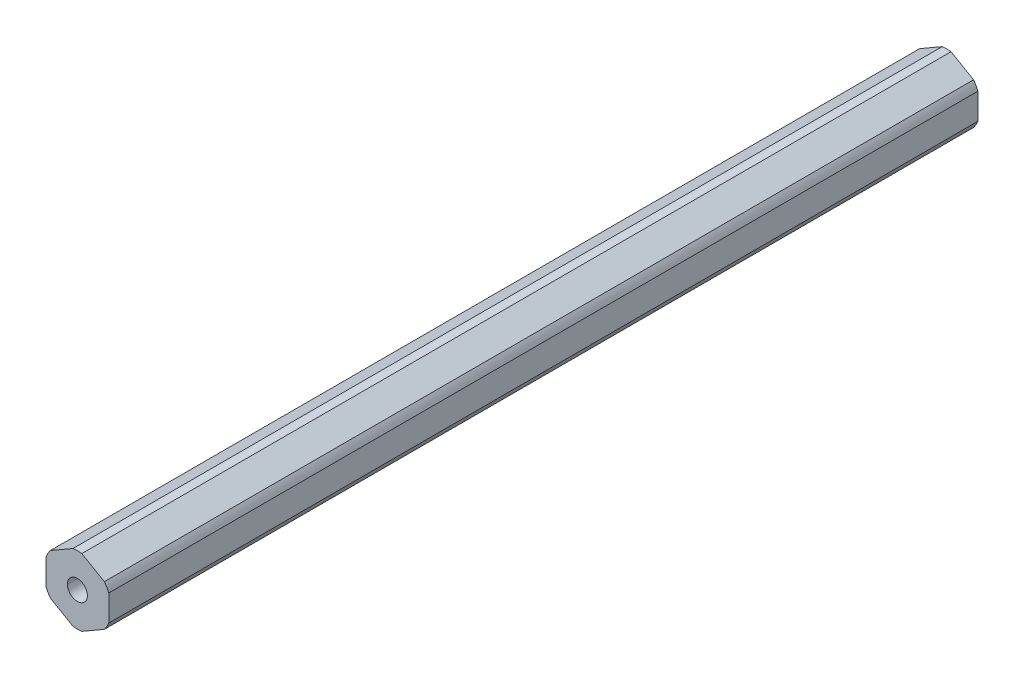
ISO-10303-21;
HEADER;
FILE_DESCRIPTION(('STEP AP214'),'2;1');
FILE_NAME('part.step','',(''),(''),'','','');
FILE_SCHEMA(('AUTOMOTIVE_DESIGN { 1 0 10303 214 1 1 1 1 }'));
ENDSEC;
DATA;
#1=APPLICATION_CONTEXT('core data for automotive mechanical design processes');
#2=APPLICATION_PROTOCOL_DEFINITION('international standard','automotive_design',2000,#1);
#3=PRODUCT_CONTEXT('',#1,'mechanical');
#4=PRODUCT('Part','Part','',(#3));
#5=PRODUCT_RELATED_PRODUCT_CATEGORY('part','',(#4));
#6=PRODUCT_DEFINITION_FORMATION('','',#4);
#7=PRODUCT_DEFINITION_CONTEXT('part definition',#1,'design');
#8=PRODUCT_DEFINITION('design','',#6,#7);
#9=PRODUCT_DEFINITION_SHAPE('','',#8);
#10=(LENGTH_UNIT() NAMED_UNIT(*) SI_UNIT(.MILLI.,.METRE.));
#11=(NAMED_UNIT(*) PLANE_ANGLE_UNIT() SI_UNIT($,.RADIAN.));
#12=(NAMED_UNIT(*) SI_UNIT($,.STERADIAN.) SOLID_ANGLE_UNIT());
#13=UNCERTAINTY_MEASURE_WITH_UNIT(LENGTH_MEASURE(1.E-05),#10,'distance_accuracy_value','');
#14=(GEOMETRIC_REPRESENTATION_CONTEXT(3) GLOBAL_UNCERTAINTY_ASSIGNED_CONTEXT((#13)) GLOBAL_UNIT_ASSIGNED_CONTEXT((#10,
#11,#12)) REPRESENTATION_CONTEXT('',''));
#15=CARTESIAN_POINT('',(0.,0.,0.));
#16=DIRECTION('',(0.,0.,1.));
#17=DIRECTION('',(1.,0.,0.));
#18=AXIS2_PLACEMENT_3D('',#15,#16,#17);
#19=CARTESIAN_POINT('',(0.,0.,457.2));
#20=DIRECTION('',(0.,0.,-1.));
#21=DIRECTION('',(-1.,0.,0.));
#22=AXIS2_PLACEMENT_3D('',#19,#20,#21);
#23=CYLINDRICAL_SURFACE('',#22,6.87);
#24=DIRECTION('',(0.,0.,-1.));
#25=VECTOR('',#24,1.);
#26=CARTESIAN_POINT('',(6.345,-2.63398462410091,457.2));
#27=LINE('',#26,#25);
#28=CARTESIAN_POINT('',(6.345,-2.63398462410091,-281.432));
#29=VERTEX_POINT('',#28);
#30=CARTESIAN_POINT('',(6.345,-2.63398462410091,-457.2));
#31=VERTEX_POINT('',#30);
#32=EDGE_CURVE('E226',#29,#31,#27,.T.);
#33=ORIENTED_EDGE('',*,*,#32,.F.);
#34=CARTESIAN_POINT('',(0.,0.,-281.432));
#35=DIRECTION('',(0.,0.,1.));
#36=DIRECTION('',(1.,0.,0.));
#37=AXIS2_PLACEMENT_3D('',#34,#35,#36);
#38=CIRCLE('',#37,6.87);
#39=CARTESIAN_POINT('',(5.45359759764899,-4.17793887496181,-281.432));
#40=VERTEX_POINT('',#39);
#41=EDGE_CURVE('E51',#29,#40,#38,.F.);
#42=ORIENTED_EDGE('',*,*,#41,.T.);
#43=DIRECTION('',(0.,0.,-1.));
#44=VECTOR('',#43,1.);
#45=CARTESIAN_POINT('',(5.45359759764899,-4.17793887496181,457.2));
#46=LINE('',#45,#44);
#47=CARTESIAN_POINT('',(5.45359759764899,-4.17793887496181,-457.2));
#48=VERTEX_POINT('',#47);
#49=EDGE_CURVE('E184',#40,#48,#46,.T.);
#50=ORIENTED_EDGE('',*,*,#49,.T.);
#51=CARTESIAN_POINT('',(0.,0.,-457.2));
#52=DIRECTION('',(0.,0.,1.));
#53=DIRECTION('',(1.,0.,0.));
#54=AXIS2_PLACEMENT_3D('',#51,#52,#53);
#55=CIRCLE('',#54,6.87);
#56=EDGE_CURVE('E44',#48,#31,#55,.T.);
#57=ORIENTED_EDGE('',*,*,#56,.T.);
#58=EDGE_LOOP('',(#33,#42,#50,#57));
#59=FACE_BOUND('',#58,.T.);
#60=ADVANCED_FACE('F36',(#59),#23,.T.);
#61=CARTESIAN_POINT('',(0.,0.,457.2));
#62=DIRECTION('',(0.,0.,-1.));
#63=DIRECTION('',(-1.,0.,0.));
#64=AXIS2_PLACEMENT_3D('',#61,#62,#63);
#65=CYLINDRICAL_SURFACE('',#64,2.0193);
#66=CARTESIAN_POINT('',(0.,0.,-281.432));
#67=DIRECTION('',(0.,0.,1.));
#68=DIRECTION('',(1.,0.,0.));
#69=AXIS2_PLACEMENT_3D('',#66,#67,#68);
#70=CIRCLE('',#69,2.0193);
#71=CARTESIAN_POINT('',(-2.0193,0.,-281.432));
#72=VERTEX_POINT('',#71);
#73=CARTESIAN_POINT('',(2.0193,0.,-281.432));
#74=VERTEX_POINT('',#73);
#75=EDGE_CURVE('E57',#72,#74,#70,.F.);
#76=ORIENTED_EDGE('',*,*,#75,.F.);
#77=DIRECTION('',(0.,0.,-1.));
#78=VECTOR('',#77,1.);
#79=CARTESIAN_POINT('',(-2.0193,0.,457.2));
#80=LINE('',#79,#78);
#81=CARTESIAN_POINT('',(-2.0193,0.,-457.2));
#82=VERTEX_POINT('',#81);
#83=EDGE_CURVE('E196',#72,#82,#80,.T.);
#84=ORIENTED_EDGE('',*,*,#83,.T.);
#85=CARTESIAN_POINT('',(0.,0.,-457.2));
#86=DIRECTION('',(0.,0.,1.));
#87=DIRECTION('',(1.,0.,0.));
#88=AXIS2_PLACEMENT_3D('',#85,#86,#87);
#89=CIRCLE('',#88,2.0193);
#90=CARTESIAN_POINT('',(2.0193,0.,-457.2));
#91=VERTEX_POINT('',#90);
#92=EDGE_CURVE('E186',#91,#82,#89,.T.);
#93=ORIENTED_EDGE('',*,*,#92,.F.);
#94=DIRECTION('',(0.,0.,-1.));
#95=VECTOR('',#94,1.);
#96=CARTESIAN_POINT('',(2.0193,0.,457.2));
#97=LINE('',#96,#95);
#98=EDGE_CURVE('E166',#74,#91,#97,.T.);
#99=ORIENTED_EDGE('',*,*,#98,.F.);
#100=EDGE_LOOP('',(#76,#84,#93,#99));
#101=FACE_BOUND('',#100,.T.);
#102=ADVANCED_FACE('F320',(#101),#65,.F.);
#103=CARTESIAN_POINT('',(3.1725,-5.49493118701227,457.2));
#104=DIRECTION('',(-0.5,0.866025403784439,0.));
#105=DIRECTION('',(0.,0.,1.));
#106=AXIS2_PLACEMENT_3D('',#103,#104,#105);
#107=PLANE('',#106);
#108=DIRECTION('',(0.866025403784439,0.5,0.));
#109=VECTOR('',#108,1.);
#110=CARTESIAN_POINT('',(3.1725,-5.49493118701227,-281.432));
#111=LINE('',#110,#109);
#112=CARTESIAN_POINT('',(0.891402402351008,-6.81192349906272,-281.432));
#113=VERTEX_POINT('',#112);
#114=EDGE_CURVE('E272',#113,#40,#111,.T.);
#115=ORIENTED_EDGE('',*,*,#114,.F.);
#116=DIRECTION('',(0.,0.,-1.));
#117=VECTOR('',#116,1.);
#118=CARTESIAN_POINT('',(0.891402402351008,-6.81192349906272,457.2));
#119=LINE('',#118,#117);
#120=CARTESIAN_POINT('',(0.891402402351008,-6.81192349906272,-457.2));
#121=VERTEX_POINT('',#120);
#122=EDGE_CURVE('E199',#113,#121,#119,.T.);
#123=ORIENTED_EDGE('',*,*,#122,.T.);
#124=DIRECTION('',(0.866025403784439,0.5,0.));
#125=VECTOR('',#124,1.);
#126=CARTESIAN_POINT('',(3.1725,-5.49493118701227,-457.2));
#127=LINE('',#126,#125);
#128=EDGE_CURVE('E187',#121,#48,#127,.T.);
#129=ORIENTED_EDGE('',*,*,#128,.T.);
#130=ORIENTED_EDGE('',*,*,#49,.F.);
#131=EDGE_LOOP('',(#115,#123,#129,#130));
#132=FACE_BOUND('',#131,.T.);
#133=ADVANCED_FACE('F314',(#132),#107,.F.);
#134=CARTESIAN_POINT('',(0.,0.,457.2));
#135=DIRECTION('',(0.,0.,-1.));
#136=DIRECTION('',(-1.,0.,0.));
#137=AXIS2_PLACEMENT_3D('',#134,#135,#136);
#138=CYLINDRICAL_SURFACE('',#137,6.87);
#139=ORIENTED_EDGE('',*,*,#122,.F.);
#140=CARTESIAN_POINT('',(0.,0.,-281.432));
#141=DIRECTION('',(0.,0.,1.));
#142=DIRECTION('',(1.,0.,0.));
#143=AXIS2_PLACEMENT_3D('',#140,#141,#142);
#144=CIRCLE('',#143,6.87);
#145=CARTESIAN_POINT('',(-0.891402402351014,-6.81192349906272,-281.432));
#146=VERTEX_POINT('',#145);
#147=EDGE_CURVE('E269',#113,#146,#144,.F.);
#148=ORIENTED_EDGE('',*,*,#147,.T.);
#149=DIRECTION('',(0.,0.,-1.));
#150=VECTOR('',#149,1.);
#151=CARTESIAN_POINT('',(-0.891402402351014,-6.81192349906272,457.2));
#152=LINE('',#151,#150);
#153=CARTESIAN_POINT('',(-0.891402402351014,-6.81192349906272,-457.2));
#154=VERTEX_POINT('',#153);
#155=EDGE_CURVE('E188',#146,#154,#152,.T.);
#156=ORIENTED_EDGE('',*,*,#155,.T.);
#157=CARTESIAN_POINT('',(0.,0.,-457.2));
#158=DIRECTION('',(0.,0.,1.));
#159=DIRECTION('',(1.,0.,0.));
#160=AXIS2_PLACEMENT_3D('',#157,#158,#159);
#161=CIRCLE('',#160,6.87);
#162=EDGE_CURVE('E190',#154,#121,#161,.T.);
#163=ORIENTED_EDGE('',*,*,#162,.T.);
#164=EDGE_LOOP('',(#139,#148,#156,#163));
#165=FACE_BOUND('',#164,.T.);
#166=ADVANCED_FACE('F38',(#165),#138,.T.);
#167=CARTESIAN_POINT('',(-3.1725,-5.49493118701226,457.2));
#168=DIRECTION('',(0.5,0.866025403784439,0.));
#169=DIRECTION('',(0.,0.,-1.));
#170=AXIS2_PLACEMENT_3D('',#167,#168,#169);
#171=PLANE('',#170);
#172=DIRECTION('',(0.866025403784439,-0.5,0.));
#173=VECTOR('',#172,1.);
#174=CARTESIAN_POINT('',(-3.1725,-5.49493118701226,-281.432));
#175=LINE('',#174,#173);
#176=CARTESIAN_POINT('',(-5.45359759764899,-4.17793887496181,-281.432));
#177=VERTEX_POINT('',#176);
#178=EDGE_CURVE('E167',#177,#146,#175,.T.);
#179=ORIENTED_EDGE('',*,*,#178,.F.);
#180=DIRECTION('',(0.,0.,-1.));
#181=VECTOR('',#180,1.);
#182=CARTESIAN_POINT('',(-5.45359759764899,-4.17793887496181,457.2));
#183=LINE('',#182,#181);
#184=CARTESIAN_POINT('',(-5.45359759764899,-4.17793887496181,-457.2));
#185=VERTEX_POINT('',#184);
#186=EDGE_CURVE('E165',#177,#185,#183,.T.);
#187=ORIENTED_EDGE('',*,*,#186,.T.);
#188=DIRECTION('',(0.866025403784439,-0.5,0.));
#189=VECTOR('',#188,1.);
#190=CARTESIAN_POINT('',(-3.1725,-5.49493118701226,-457.2));
#191=LINE('',#190,#189);
#192=EDGE_CURVE('E191',#185,#154,#191,.T.);
#193=ORIENTED_EDGE('',*,*,#192,.T.);
#194=ORIENTED_EDGE('',*,*,#155,.F.);
#195=EDGE_LOOP('',(#179,#187,#193,#194));
#196=FACE_BOUND('',#195,.T.);
#197=ADVANCED_FACE('F311',(#196),#171,.F.);
#198=CARTESIAN_POINT('',(0.,0.,457.2));
#199=DIRECTION('',(0.,0.,-1.));
#200=DIRECTION('',(-1.,0.,0.));
#201=AXIS2_PLACEMENT_3D('',#198,#199,#200);
#202=CYLINDRICAL_SURFACE('',#201,6.87);
#203=ORIENTED_EDGE('',*,*,#186,.F.);
#204=CARTESIAN_POINT('',(0.,0.,-281.432));
#205=DIRECTION('',(0.,0.,1.));
#206=DIRECTION('',(1.,0.,0.));
#207=AXIS2_PLACEMENT_3D('',#204,#205,#206);
#208=CIRCLE('',#207,6.87);
#209=CARTESIAN_POINT('',(-6.345,-2.63398462410091,-281.432));
#210=VERTEX_POINT('',#209);
#211=EDGE_CURVE('E151',#177,#210,#208,.F.);
#212=ORIENTED_EDGE('',*,*,#211,.T.);
#213=DIRECTION('',(0.,0.,-1.));
#214=VECTOR('',#213,1.);
#215=CARTESIAN_POINT('',(-6.345,-2.63398462410091,457.2));
#216=LINE('',#215,#214);
#217=CARTESIAN_POINT('',(-6.345,-2.63398462410091,-457.2));
#218=VERTEX_POINT('',#217);
#219=EDGE_CURVE('E163',#210,#218,#216,.T.);
#220=ORIENTED_EDGE('',*,*,#219,.T.);
#221=CARTESIAN_POINT('',(0.,0.,-457.2));
#222=DIRECTION('',(0.,0.,1.));
#223=DIRECTION('',(1.,0.,0.));
#224=AXIS2_PLACEMENT_3D('',#221,#222,#223);
#225=CIRCLE('',#224,6.87);
#226=EDGE_CURVE('E173',#218,#185,#225,.T.);
#227=ORIENTED_EDGE('',*,*,#226,.T.);
#228=EDGE_LOOP('',(#203,#212,#220,#227));
#229=FACE_BOUND('',#228,.T.);
#230=ADVANCED_FACE('F161',(#229),#202,.T.);
#231=CARTESIAN_POINT('',(-6.345,0.,457.2));
#232=DIRECTION('',(1.,0.,0.));
#233=DIRECTION('',(0.,1.,0.));
#234=AXIS2_PLACEMENT_3D('',#231,#232,#233);
#235=PLANE('',#234);
#236=DIRECTION('',(0.,1.,0.));
#237=VECTOR('',#236,1.);
#238=CARTESIAN_POINT('',(-6.345,0.,-281.432));
#239=LINE('',#238,#237);
#240=CARTESIAN_POINT('',(-6.345,2.63398462410091,-281.432));
#241=VERTEX_POINT('',#240);
#242=EDGE_CURVE('E148',#210,#241,#239,.T.);
#243=ORIENTED_EDGE('',*,*,#242,.T.);
#244=DIRECTION('',(0.,0.,-1.));
#245=VECTOR('',#244,1.);
#246=CARTESIAN_POINT('',(-6.345,2.63398462410091,457.2));
#247=LINE('',#246,#245);
#248=CARTESIAN_POINT('',(-6.345,2.63398462410091,-457.2));
#249=VERTEX_POINT('',#248);
#250=EDGE_CURVE('E178',#241,#249,#247,.T.);
#251=ORIENTED_EDGE('',*,*,#250,.T.);
#252=DIRECTION('',(0.,-1.,0.));
#253=VECTOR('',#252,1.);
#254=CARTESIAN_POINT('',(-6.345,0.,-457.2));
#255=LINE('',#254,#253);
#256=EDGE_CURVE('E172',#249,#218,#255,.T.);
#257=ORIENTED_EDGE('',*,*,#256,.T.);
#258=ORIENTED_EDGE('',*,*,#219,.F.);
#259=EDGE_LOOP('',(#243,#251,#257,#258));
#260=FACE_BOUND('',#259,.T.);
#261=ADVANCED_FACE('F170',(#260),#235,.F.);
#262=CARTESIAN_POINT('',(0.,0.,457.2));
#263=DIRECTION('',(0.,0.,-1.));
#264=DIRECTION('',(-1.,0.,0.));
#265=AXIS2_PLACEMENT_3D('',#262,#263,#264);
#266=CYLINDRICAL_SURFACE('',#265,6.87);
#267=ORIENTED_EDGE('',*,*,#250,.F.);
#268=CARTESIAN_POINT('',(0.,0.,-281.432));
#269=DIRECTION('',(0.,0.,1.));
#270=DIRECTION('',(1.,0.,0.));
#271=AXIS2_PLACEMENT_3D('',#268,#269,#270);
#272=CIRCLE('',#271,6.87);
#273=CARTESIAN_POINT('',(-5.45359759764899,4.17793887496182,-281.432));
#274=VERTEX_POINT('',#273);
#275=EDGE_CURVE('E154',#241,#274,#272,.F.);
#276=ORIENTED_EDGE('',*,*,#275,.T.);
#277=DIRECTION('',(0.,0.,-1.));
#278=VECTOR('',#277,1.);
#279=CARTESIAN_POINT('',(-5.45359759764899,4.17793887496182,457.2));
#280=LINE('',#279,#278);
#281=CARTESIAN_POINT('',(-5.45359759764899,4.17793887496182,-457.2));
#282=VERTEX_POINT('',#281);
#283=EDGE_CURVE('E259',#274,#282,#280,.T.);
#284=ORIENTED_EDGE('',*,*,#283,.T.);
#285=CARTESIAN_POINT('',(0.,0.,-457.2));
#286=DIRECTION('',(0.,0.,1.));
#287=DIRECTION('',(1.,0.,0.));
#288=AXIS2_PLACEMENT_3D('',#285,#286,#287);
#289=CIRCLE('',#288,6.87);
#290=EDGE_CURVE('E181',#282,#249,#289,.T.);
#291=ORIENTED_EDGE('',*,*,#290,.T.);
#292=EDGE_LOOP('',(#267,#276,#284,#291));
#293=FACE_BOUND('',#292,.T.);
#294=ADVANCED_FACE('F333',(#293),#266,.T.);
#295=CARTESIAN_POINT('',(-3.1725,5.49493118701227,457.2));
#296=DIRECTION('',(0.5,-0.866025403784439,0.));
#297=DIRECTION('',(0.,0.,-1.));
#298=AXIS2_PLACEMENT_3D('',#295,#296,#297);
#299=PLANE('',#298);
#300=DIRECTION('',(-0.866025403784439,-0.5,0.));
#301=VECTOR('',#300,1.);
#302=CARTESIAN_POINT('',(-3.1725,5.49493118701227,-281.432));
#303=LINE('',#302,#301);
#304=CARTESIAN_POINT('',(-0.891402402351016,6.81192349906272,-281.432));
#305=VERTEX_POINT('',#304);
#306=EDGE_CURVE('E276',#305,#274,#303,.T.);
#307=ORIENTED_EDGE('',*,*,#306,.F.);
#308=DIRECTION('',(0.,0.,-1.));
#309=VECTOR('',#308,1.);
#310=CARTESIAN_POINT('',(-0.891402402351017,6.81192349906272,457.2));
#311=LINE('',#310,#309);
#312=CARTESIAN_POINT('',(-0.891402402351017,6.81192349906272,-457.2));
#313=VERTEX_POINT('',#312);
#314=EDGE_CURVE('E235',#305,#313,#311,.T.);
#315=ORIENTED_EDGE('',*,*,#314,.T.);
#316=DIRECTION('',(-0.866025403784439,-0.5,0.));
#317=VECTOR('',#316,1.);
#318=CARTESIAN_POINT('',(-3.1725,5.49493118701227,-457.2));
#319=LINE('',#318,#317);
#320=EDGE_CURVE('E212',#313,#282,#319,.T.);
#321=ORIENTED_EDGE('',*,*,#320,.T.);
#322=ORIENTED_EDGE('',*,*,#283,.F.);
#323=EDGE_LOOP('',(#307,#315,#321,#322));
#324=FACE_BOUND('',#323,.T.);
#325=ADVANCED_FACE('F306',(#324),#299,.F.);
#326=CARTESIAN_POINT('',(0.,0.,457.2));
#327=DIRECTION('',(0.,0.,-1.));
#328=DIRECTION('',(-1.,0.,0.));
#329=AXIS2_PLACEMENT_3D('',#326,#327,#328);
#330=CYLINDRICAL_SURFACE('',#329,6.87);
#331=ORIENTED_EDGE('',*,*,#314,.F.);
#332=CARTESIAN_POINT('',(0.,0.,-281.432));
#333=DIRECTION('',(0.,0.,1.));
#334=DIRECTION('',(1.,0.,0.));
#335=AXIS2_PLACEMENT_3D('',#332,#333,#334);
#336=CIRCLE('',#335,6.87);
#337=CARTESIAN_POINT('',(0.891402402351022,6.81192349906272,-281.432));
#338=VERTEX_POINT('',#337);
#339=EDGE_CURVE('E278',#305,#338,#336,.F.);
#340=ORIENTED_EDGE('',*,*,#339,.T.);
#341=DIRECTION('',(0.,0.,-1.));
#342=VECTOR('',#341,1.);
#343=CARTESIAN_POINT('',(0.891402402351022,6.81192349906272,457.2));
#344=LINE('',#343,#342);
#345=CARTESIAN_POINT('',(0.891402402351022,6.81192349906272,-457.2));
#346=VERTEX_POINT('',#345);
#347=EDGE_CURVE('E222',#338,#346,#344,.T.);
#348=ORIENTED_EDGE('',*,*,#347,.T.);
#349=CARTESIAN_POINT('',(0.,0.,-457.2));
#350=DIRECTION('',(0.,0.,1.));
#351=DIRECTION('',(1.,0.,0.));
#352=AXIS2_PLACEMENT_3D('',#349,#350,#351);
#353=CIRCLE('',#352,6.87);
#354=EDGE_CURVE('E244',#346,#313,#353,.T.);
#355=ORIENTED_EDGE('',*,*,#354,.T.);
#356=EDGE_LOOP('',(#331,#340,#348,#355));
#357=FACE_BOUND('',#356,.T.);
#358=ADVANCED_FACE('F303',(#357),#330,.T.);
#359=CARTESIAN_POINT('',(3.1725,5.49493118701227,457.2));
#360=DIRECTION('',(-0.5,-0.866025403784439,0.));
#361=DIRECTION('',(-0.866025403784439,0.5,0.));
#362=AXIS2_PLACEMENT_3D('',#359,#360,#361);
#363=PLANE('',#362);
#364=DIRECTION('',(-0.866025403784439,0.5,0.));
#365=VECTOR('',#364,1.);
#366=CARTESIAN_POINT('',(3.1725,5.49493118701227,-281.432));
#367=LINE('',#366,#365);
#368=CARTESIAN_POINT('',(5.45359759764898,4.17793887496182,-281.432));
#369=VERTEX_POINT('',#368);
#370=EDGE_CURVE('E281',#369,#338,#367,.T.);
#371=ORIENTED_EDGE('',*,*,#370,.F.);
#372=DIRECTION('',(0.,0.,-1.));
#373=VECTOR('',#372,1.);
#374=CARTESIAN_POINT('',(5.45359759764898,4.17793887496182,457.2));
#375=LINE('',#374,#373);
#376=CARTESIAN_POINT('',(5.45359759764898,4.17793887496182,-457.2));
#377=VERTEX_POINT('',#376);
#378=EDGE_CURVE('E213',#369,#377,#375,.T.);
#379=ORIENTED_EDGE('',*,*,#378,.T.);
#380=DIRECTION('',(-0.866025403784439,0.5,0.));
#381=VECTOR('',#380,1.);
#382=CARTESIAN_POINT('',(3.1725,5.49493118701227,-457.2));
#383=LINE('',#382,#381);
#384=EDGE_CURVE('E214',#377,#346,#383,.T.);
#385=ORIENTED_EDGE('',*,*,#384,.T.);
#386=ORIENTED_EDGE('',*,*,#347,.F.);
#387=EDGE_LOOP('',(#371,#379,#385,#386));
#388=FACE_BOUND('',#387,.T.);
#389=ADVANCED_FACE('F300',(#388),#363,.F.);
#390=CARTESIAN_POINT('',(0.,0.,457.2));
#391=DIRECTION('',(0.,0.,-1.));
#392=DIRECTION('',(-1.,0.,0.));
#393=AXIS2_PLACEMENT_3D('',#390,#391,#392);
#394=CYLINDRICAL_SURFACE('',#393,6.87);
#395=ORIENTED_EDGE('',*,*,#378,.F.);
#396=CARTESIAN_POINT('',(0.,0.,-281.432));
#397=DIRECTION('',(0.,0.,1.));
#398=DIRECTION('',(1.,0.,0.));
#399=AXIS2_PLACEMENT_3D('',#396,#397,#398);
#400=CIRCLE('',#399,6.87);
#401=CARTESIAN_POINT('',(6.345,2.63398462410091,-281.432));
#402=VERTEX_POINT('',#401);
#403=EDGE_CURVE('E283',#369,#402,#400,.F.);
#404=ORIENTED_EDGE('',*,*,#403,.T.);
#405=DIRECTION('',(0.,0.,-1.));
#406=VECTOR('',#405,1.);
#407=CARTESIAN_POINT('',(6.345,2.63398462410091,457.2));
#408=LINE('',#407,#406);
#409=CARTESIAN_POINT('',(6.345,2.63398462410091,-457.2));
#410=VERTEX_POINT('',#409);
#411=EDGE_CURVE('E195',#402,#410,#408,.T.);
#412=ORIENTED_EDGE('',*,*,#411,.T.);
#413=CARTESIAN_POINT('',(0.,0.,-457.2));
#414=DIRECTION('',(0.,0.,1.));
#415=DIRECTION('',(1.,0.,0.));
#416=AXIS2_PLACEMENT_3D('',#413,#414,#415);
#417=CIRCLE('',#416,6.87);
#418=EDGE_CURVE('E215',#410,#377,#417,.T.);
#419=ORIENTED_EDGE('',*,*,#418,.T.);
#420=EDGE_LOOP('',(#395,#404,#412,#419));
#421=FACE_BOUND('',#420,.T.);
#422=ADVANCED_FACE('F291',(#421),#394,.T.);
#423=CARTESIAN_POINT('',(6.345,0.,457.2));
#424=DIRECTION('',(-1.,0.,0.));
#425=DIRECTION('',(0.,1.,0.));
#426=AXIS2_PLACEMENT_3D('',#423,#424,#425);
#427=PLANE('',#426);
#428=DIRECTION('',(0.,1.,0.));
#429=VECTOR('',#428,1.);
#430=CARTESIAN_POINT('',(6.345,0.,-281.432));
#431=LINE('',#430,#429);
#432=EDGE_CURVE('E286',#29,#402,#431,.T.);
#433=ORIENTED_EDGE('',*,*,#432,.F.);
#434=ORIENTED_EDGE('',*,*,#32,.T.);
#435=DIRECTION('',(0.,1.,0.));
#436=VECTOR('',#435,1.);
#437=CARTESIAN_POINT('',(6.345,0.,-457.2));
#438=LINE('',#437,#436);
#439=EDGE_CURVE('E192',#31,#410,#438,.T.);
#440=ORIENTED_EDGE('',*,*,#439,.T.);
#441=ORIENTED_EDGE('',*,*,#411,.F.);
#442=EDGE_LOOP('',(#433,#434,#440,#441));
#443=FACE_BOUND('',#442,.T.);
#444=ADVANCED_FACE('F292',(#443),#427,.F.);
#445=CARTESIAN_POINT('',(0.,0.,457.2));
#446=DIRECTION('',(0.,0.,-1.));
#447=DIRECTION('',(-1.,0.,0.));
#448=AXIS2_PLACEMENT_3D('',#445,#446,#447);
#449=CYLINDRICAL_SURFACE('',#448,2.0193);
#450=CARTESIAN_POINT('',(0.,0.,-281.432));
#451=DIRECTION('',(0.,0.,1.));
#452=DIRECTION('',(1.,0.,0.));
#453=AXIS2_PLACEMENT_3D('',#450,#451,#452);
#454=CIRCLE('',#453,2.0193);
#455=EDGE_CURVE('E11',#74,#72,#454,.F.);
#456=ORIENTED_EDGE('',*,*,#455,.F.);
#457=ORIENTED_EDGE('',*,*,#98,.T.);
#458=CARTESIAN_POINT('',(0.,0.,-457.2));
#459=DIRECTION('',(0.,0.,1.));
#460=DIRECTION('',(1.,0.,0.));
#461=AXIS2_PLACEMENT_3D('',#458,#459,#460);
#462=CIRCLE('',#461,2.0193);
#463=EDGE_CURVE('E237',#82,#91,#462,.T.);
#464=ORIENTED_EDGE('',*,*,#463,.F.);
#465=ORIENTED_EDGE('',*,*,#83,.F.);
#466=EDGE_LOOP('',(#456,#457,#464,#465));
#467=FACE_BOUND('',#466,.T.);
#468=ADVANCED_FACE('F341',(#467),#449,.F.);
#469=CARTESIAN_POINT('',(0.,0.,-457.2));
#470=DIRECTION('',(0.,0.,1.));
#471=DIRECTION('',(1.,0.,0.));
#472=AXIS2_PLACEMENT_3D('',#469,#470,#471);
#473=PLANE('',#472);
#474=ORIENTED_EDGE('',*,*,#463,.T.);
#475=ORIENTED_EDGE('',*,*,#92,.T.);
#476=EDGE_LOOP('',(#474,#475));
#477=FACE_BOUND('',#476,.T.);
#478=ORIENTED_EDGE('',*,*,#439,.F.);
#479=ORIENTED_EDGE('',*,*,#56,.F.);
#480=ORIENTED_EDGE('',*,*,#128,.F.);
#481=ORIENTED_EDGE('',*,*,#162,.F.);
#482=ORIENTED_EDGE('',*,*,#192,.F.);
#483=ORIENTED_EDGE('',*,*,#226,.F.);
#484=ORIENTED_EDGE('',*,*,#256,.F.);
#485=ORIENTED_EDGE('',*,*,#290,.F.);
#486=ORIENTED_EDGE('',*,*,#320,.F.);
#487=ORIENTED_EDGE('',*,*,#354,.F.);
#488=ORIENTED_EDGE('',*,*,#384,.F.);
#489=ORIENTED_EDGE('',*,*,#418,.F.);
#490=EDGE_LOOP('',(#478,#479,#480,#481,#482,#483,#484,#485,#486,#487,#488,#489));
#491=FACE_BOUND('',#490,.T.);
#492=ADVANCED_FACE('F296',(#477,#491),#473,.F.);
#493=CARTESIAN_POINT('',(48.519,0.,-281.432));
#494=DIRECTION('',(0.,0.,1.));
#495=DIRECTION('',(1.,0.,0.));
#496=AXIS2_PLACEMENT_3D('',#493,#494,#495);
#497=PLANE('',#496);
#498=ORIENTED_EDGE('',*,*,#178,.T.);
#499=ORIENTED_EDGE('',*,*,#147,.F.);
#500=ORIENTED_EDGE('',*,*,#114,.T.);
#501=ORIENTED_EDGE('',*,*,#41,.F.);
#502=ORIENTED_EDGE('',*,*,#432,.T.);
#503=ORIENTED_EDGE('',*,*,#403,.F.);
#504=ORIENTED_EDGE('',*,*,#370,.T.);
#505=ORIENTED_EDGE('',*,*,#339,.F.);
#506=ORIENTED_EDGE('',*,*,#306,.T.);
#507=ORIENTED_EDGE('',*,*,#275,.F.);
#508=ORIENTED_EDGE('',*,*,#242,.F.);
#509=ORIENTED_EDGE('',*,*,#211,.F.);
#510=EDGE_LOOP('',(#498,#499,#500,#501,#502,#503,#504,#505,#506,#507,#508,#509));
#511=FACE_BOUND('',#510,.T.);
#512=ORIENTED_EDGE('',*,*,#75,.T.);
#513=ORIENTED_EDGE('',*,*,#455,.T.);
#514=EDGE_LOOP('',(#512,#513));
#515=FACE_BOUND('',#514,.T.);
#516=ADVANCED_FACE('F150',(#511,#515),#497,.T.);
#517=CLOSED_SHELL('',(#60,#102,#133,#166,#197,#230,#261,#294,#325,#358,#389,#422,#444,#468,#492,#516));
#518=MANIFOLD_SOLID_BREP('B2',#517);
#519=ADVANCED_BREP_SHAPE_REPRESENTATION('',(#18,#518),#14);
#520=SHAPE_DEFINITION_REPRESENTATION(#9,#519);
ENDSEC;
END-ISO-10303-21;
